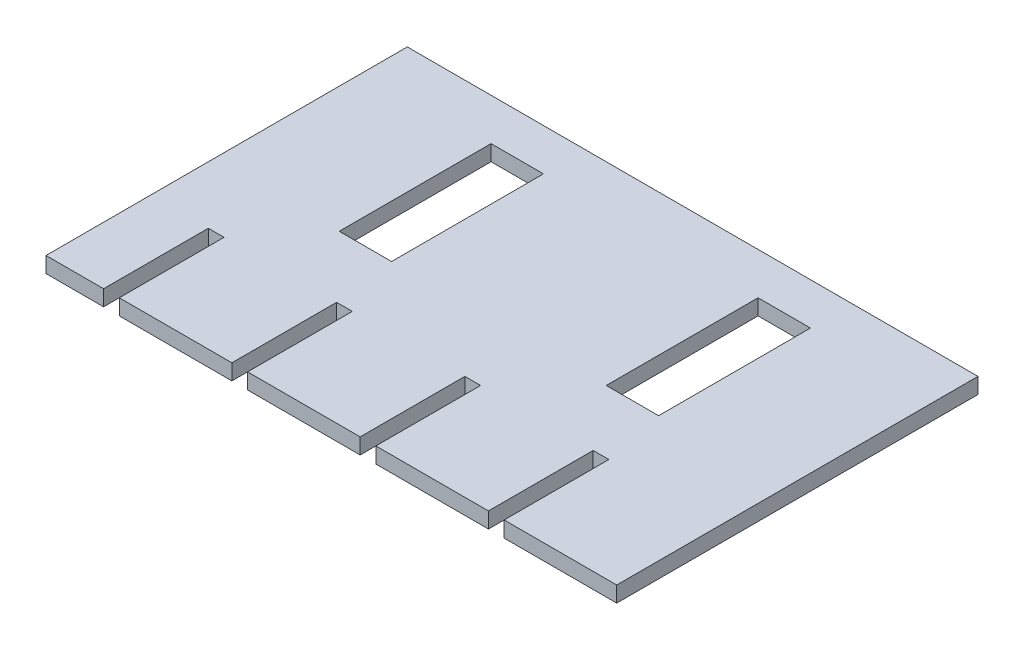
ISO-10303-21;
HEADER;
FILE_DESCRIPTION(('STEP AP214'),'2;1');
FILE_NAME('part.step','',(''),(''),'','','');
FILE_SCHEMA(('AUTOMOTIVE_DESIGN { 1 0 10303 214 1 1 1 1 }'));
ENDSEC;
DATA;
#1=APPLICATION_CONTEXT('core data for automotive mechanical design processes');
#2=APPLICATION_PROTOCOL_DEFINITION('international standard','automotive_design',2000,#1);
#3=PRODUCT_CONTEXT('',#1,'mechanical');
#4=PRODUCT('Part','Part','',(#3));
#5=PRODUCT_RELATED_PRODUCT_CATEGORY('part','',(#4));
#6=PRODUCT_DEFINITION_FORMATION('','',#4);
#7=PRODUCT_DEFINITION_CONTEXT('part definition',#1,'design');
#8=PRODUCT_DEFINITION('design','',#6,#7);
#9=PRODUCT_DEFINITION_SHAPE('','',#8);
#10=(LENGTH_UNIT() NAMED_UNIT(*) SI_UNIT(.MILLI.,.METRE.));
#11=(NAMED_UNIT(*) PLANE_ANGLE_UNIT() SI_UNIT($,.RADIAN.));
#12=(NAMED_UNIT(*) SI_UNIT($,.STERADIAN.) SOLID_ANGLE_UNIT());
#13=UNCERTAINTY_MEASURE_WITH_UNIT(LENGTH_MEASURE(1.E-05),#10,'distance_accuracy_value','');
#14=(GEOMETRIC_REPRESENTATION_CONTEXT(3) GLOBAL_UNCERTAINTY_ASSIGNED_CONTEXT((#13)) GLOBAL_UNIT_ASSIGNED_CONTEXT((#10,
#11,#12)) REPRESENTATION_CONTEXT('',''));
#15=CARTESIAN_POINT('',(0.,0.,0.));
#16=DIRECTION('',(0.,0.,1.));
#17=DIRECTION('',(1.,0.,0.));
#18=AXIS2_PLACEMENT_3D('',#15,#16,#17);
#19=CARTESIAN_POINT('',(-27.25,1.5,17.25));
#20=DIRECTION('',(0.,0.,-1.));
#21=DIRECTION('',(-1.,0.,0.));
#22=AXIS2_PLACEMENT_3D('',#19,#20,#21);
#23=PLANE('',#22);
#24=DIRECTION('',(1.,0.,0.));
#25=VECTOR('',#24,1.);
#26=CARTESIAN_POINT('',(-27.25,0.,17.25));
#27=LINE('',#26,#25);
#28=CARTESIAN_POINT('',(4.25,0.,17.25));
#29=VERTEX_POINT('',#28);
#30=CARTESIAN_POINT('',(15.,0.,17.25));
#31=VERTEX_POINT('',#30);
#32=EDGE_CURVE('E461',#29,#31,#27,.T.);
#33=ORIENTED_EDGE('',*,*,#32,.T.);
#34=DIRECTION('',(0.,1.,0.));
#35=VECTOR('',#34,1.);
#36=CARTESIAN_POINT('',(15.,-0.5,17.25));
#37=LINE('',#36,#35);
#38=CARTESIAN_POINT('',(15.,1.5,17.25));
#39=VERTEX_POINT('',#38);
#40=EDGE_CURVE('E425',#31,#39,#37,.T.);
#41=ORIENTED_EDGE('',*,*,#40,.T.);
#42=DIRECTION('',(1.,0.,0.));
#43=VECTOR('',#42,1.);
#44=CARTESIAN_POINT('',(-27.25,1.5,17.25));
#45=LINE('',#44,#43);
#46=CARTESIAN_POINT('',(4.25,1.5,17.25));
#47=VERTEX_POINT('',#46);
#48=EDGE_CURVE('E242',#47,#39,#45,.T.);
#49=ORIENTED_EDGE('',*,*,#48,.F.);
#50=DIRECTION('',(0.,1.,0.));
#51=VECTOR('',#50,1.);
#52=CARTESIAN_POINT('',(4.25,-0.5,17.25));
#53=LINE('',#52,#51);
#54=EDGE_CURVE('E300',#29,#47,#53,.T.);
#55=ORIENTED_EDGE('',*,*,#54,.F.);
#56=EDGE_LOOP('',(#33,#41,#49,#55));
#57=FACE_BOUND('',#56,.T.);
#58=ADVANCED_FACE('F33',(#57),#23,.F.);
#59=CARTESIAN_POINT('',(-20.25,0.,17.25));
#60=VERTEX_POINT('',#59);
#61=CARTESIAN_POINT('',(-9.5,0.,17.25));
#62=VERTEX_POINT('',#61);
#63=EDGE_CURVE('E274',#60,#62,#27,.T.);
#64=ORIENTED_EDGE('',*,*,#63,.T.);
#65=DIRECTION('',(0.,1.,0.));
#66=VECTOR('',#65,1.);
#67=CARTESIAN_POINT('',(-9.5,-0.5,17.25));
#68=LINE('',#67,#66);
#69=CARTESIAN_POINT('',(-9.5,1.5,17.25));
#70=VERTEX_POINT('',#69);
#71=EDGE_CURVE('E273',#62,#70,#68,.T.);
#72=ORIENTED_EDGE('',*,*,#71,.T.);
#73=CARTESIAN_POINT('',(-20.25,1.5,17.25));
#74=VERTEX_POINT('',#73);
#75=EDGE_CURVE('E248',#74,#70,#45,.T.);
#76=ORIENTED_EDGE('',*,*,#75,.F.);
#77=DIRECTION('',(0.,1.,0.));
#78=VECTOR('',#77,1.);
#79=CARTESIAN_POINT('',(-20.25,-0.5,17.25));
#80=LINE('',#79,#78);
#81=EDGE_CURVE('E271',#60,#74,#80,.T.);
#82=ORIENTED_EDGE('',*,*,#81,.F.);
#83=EDGE_LOOP('',(#64,#72,#76,#82));
#84=FACE_BOUND('',#83,.T.);
#85=ADVANCED_FACE('F270',(#84),#23,.F.);
#86=CARTESIAN_POINT('',(-8.,1.5,17.25));
#87=VERTEX_POINT('',#86);
#88=CARTESIAN_POINT('',(2.75,1.5,17.25));
#89=VERTEX_POINT('',#88);
#90=EDGE_CURVE('E245',#87,#89,#45,.T.);
#91=ORIENTED_EDGE('',*,*,#90,.F.);
#92=DIRECTION('',(0.,1.,0.));
#93=VECTOR('',#92,1.);
#94=CARTESIAN_POINT('',(-8.,-0.5,17.25));
#95=LINE('',#94,#93);
#96=CARTESIAN_POINT('',(-8.,0.,17.25));
#97=VERTEX_POINT('',#96);
#98=EDGE_CURVE('E288',#97,#87,#95,.T.);
#99=ORIENTED_EDGE('',*,*,#98,.F.);
#100=CARTESIAN_POINT('',(2.75,0.,17.25));
#101=VERTEX_POINT('',#100);
#102=EDGE_CURVE('E440',#97,#101,#27,.T.);
#103=ORIENTED_EDGE('',*,*,#102,.T.);
#104=DIRECTION('',(0.,1.,0.));
#105=VECTOR('',#104,1.);
#106=CARTESIAN_POINT('',(2.75,-0.5,17.25));
#107=LINE('',#106,#105);
#108=EDGE_CURVE('E295',#101,#89,#107,.T.);
#109=ORIENTED_EDGE('',*,*,#108,.T.);
#110=EDGE_LOOP('',(#91,#99,#103,#109));
#111=FACE_BOUND('',#110,.T.);
#112=ADVANCED_FACE('F446',(#111),#23,.F.);
#113=CARTESIAN_POINT('',(-27.25,0.,17.25));
#114=VERTEX_POINT('',#113);
#115=CARTESIAN_POINT('',(-21.75,0.,17.25));
#116=VERTEX_POINT('',#115);
#117=EDGE_CURVE('E361',#114,#116,#27,.T.);
#118=ORIENTED_EDGE('',*,*,#117,.T.);
#119=DIRECTION('',(0.,1.,0.));
#120=VECTOR('',#119,1.);
#121=CARTESIAN_POINT('',(-21.75,-0.5,17.25));
#122=LINE('',#121,#120);
#123=CARTESIAN_POINT('',(-21.75,1.5,17.25));
#124=VERTEX_POINT('',#123);
#125=EDGE_CURVE('E310',#116,#124,#122,.T.);
#126=ORIENTED_EDGE('',*,*,#125,.T.);
#127=CARTESIAN_POINT('',(-27.25,1.5,17.25));
#128=VERTEX_POINT('',#127);
#129=EDGE_CURVE('E246',#128,#124,#45,.T.);
#130=ORIENTED_EDGE('',*,*,#129,.F.);
#131=DIRECTION('',(0.,-1.,0.));
#132=VECTOR('',#131,1.);
#133=CARTESIAN_POINT('',(-27.25,1.5,17.25));
#134=LINE('',#133,#132);
#135=EDGE_CURVE('E255',#128,#114,#134,.T.);
#136=ORIENTED_EDGE('',*,*,#135,.T.);
#137=EDGE_LOOP('',(#118,#126,#130,#136));
#138=FACE_BOUND('',#137,.T.);
#139=ADVANCED_FACE('F383',(#138),#23,.F.);
#140=CARTESIAN_POINT('',(27.25,1.5,-17.25));
#141=DIRECTION('',(-1.,0.,0.));
#142=DIRECTION('',(0.,0.,1.));
#143=AXIS2_PLACEMENT_3D('',#140,#141,#142);
#144=PLANE('',#143);
#145=DIRECTION('',(0.,0.,-1.));
#146=VECTOR('',#145,1.);
#147=CARTESIAN_POINT('',(27.25,0.,-17.25));
#148=LINE('',#147,#146);
#149=CARTESIAN_POINT('',(27.25,0.,17.25));
#150=VERTEX_POINT('',#149);
#151=CARTESIAN_POINT('',(27.25,0.,-17.25));
#152=VERTEX_POINT('',#151);
#153=EDGE_CURVE('E352',#150,#152,#148,.T.);
#154=ORIENTED_EDGE('',*,*,#153,.T.);
#155=DIRECTION('',(0.,-1.,0.));
#156=VECTOR('',#155,1.);
#157=CARTESIAN_POINT('',(27.25,1.5,-17.25));
#158=LINE('',#157,#156);
#159=CARTESIAN_POINT('',(27.25,1.5,-17.25));
#160=VERTEX_POINT('',#159);
#161=EDGE_CURVE('E374',#160,#152,#158,.T.);
#162=ORIENTED_EDGE('',*,*,#161,.F.);
#163=DIRECTION('',(0.,0.,-1.));
#164=VECTOR('',#163,1.);
#165=CARTESIAN_POINT('',(27.25,1.5,-17.25));
#166=LINE('',#165,#164);
#167=CARTESIAN_POINT('',(27.25,1.5,17.25));
#168=VERTEX_POINT('',#167);
#169=EDGE_CURVE('E359',#168,#160,#166,.T.);
#170=ORIENTED_EDGE('',*,*,#169,.F.);
#171=DIRECTION('',(0.,-1.,0.));
#172=VECTOR('',#171,1.);
#173=CARTESIAN_POINT('',(27.25,1.5,17.25));
#174=LINE('',#173,#172);
#175=EDGE_CURVE('E240',#168,#150,#174,.T.);
#176=ORIENTED_EDGE('',*,*,#175,.T.);
#177=EDGE_LOOP('',(#154,#162,#170,#176));
#178=FACE_BOUND('',#177,.T.);
#179=ADVANCED_FACE('F35',(#178),#144,.F.);
#180=CARTESIAN_POINT('',(-27.25,1.5,-17.25));
#181=DIRECTION('',(0.,0.,1.));
#182=DIRECTION('',(1.,0.,0.));
#183=AXIS2_PLACEMENT_3D('',#180,#181,#182);
#184=PLANE('',#183);
#185=DIRECTION('',(-1.,0.,0.));
#186=VECTOR('',#185,1.);
#187=CARTESIAN_POINT('',(-27.25,0.,-17.25));
#188=LINE('',#187,#186);
#189=CARTESIAN_POINT('',(-27.25,0.,-17.25));
#190=VERTEX_POINT('',#189);
#191=EDGE_CURVE('E371',#152,#190,#188,.T.);
#192=ORIENTED_EDGE('',*,*,#191,.T.);
#193=DIRECTION('',(0.,-1.,0.));
#194=VECTOR('',#193,1.);
#195=CARTESIAN_POINT('',(-27.25,1.5,-17.25));
#196=LINE('',#195,#194);
#197=CARTESIAN_POINT('',(-27.25,1.5,-17.25));
#198=VERTEX_POINT('',#197);
#199=EDGE_CURVE('E369',#198,#190,#196,.T.);
#200=ORIENTED_EDGE('',*,*,#199,.F.);
#201=DIRECTION('',(-1.,0.,0.));
#202=VECTOR('',#201,1.);
#203=CARTESIAN_POINT('',(-27.25,1.5,-17.25));
#204=LINE('',#203,#202);
#205=EDGE_CURVE('E249',#160,#198,#204,.T.);
#206=ORIENTED_EDGE('',*,*,#205,.F.);
#207=ORIENTED_EDGE('',*,*,#161,.T.);
#208=EDGE_LOOP('',(#192,#200,#206,#207));
#209=FACE_BOUND('',#208,.T.);
#210=ADVANCED_FACE('F370',(#209),#184,.F.);
#211=CARTESIAN_POINT('',(-27.25,1.5,-17.25));
#212=DIRECTION('',(1.,0.,0.));
#213=DIRECTION('',(0.,0.,-1.));
#214=AXIS2_PLACEMENT_3D('',#211,#212,#213);
#215=PLANE('',#214);
#216=DIRECTION('',(0.,0.,1.));
#217=VECTOR('',#216,1.);
#218=CARTESIAN_POINT('',(-27.25,0.,-17.25));
#219=LINE('',#218,#217);
#220=EDGE_CURVE('E378',#190,#114,#219,.T.);
#221=ORIENTED_EDGE('',*,*,#220,.T.);
#222=ORIENTED_EDGE('',*,*,#135,.F.);
#223=DIRECTION('',(0.,0.,1.));
#224=VECTOR('',#223,1.);
#225=CARTESIAN_POINT('',(-27.25,1.5,-17.25));
#226=LINE('',#225,#224);
#227=EDGE_CURVE('E243',#198,#128,#226,.T.);
#228=ORIENTED_EDGE('',*,*,#227,.F.);
#229=ORIENTED_EDGE('',*,*,#199,.T.);
#230=EDGE_LOOP('',(#221,#222,#228,#229));
#231=FACE_BOUND('',#230,.T.);
#232=ADVANCED_FACE('F376',(#231),#215,.F.);
#233=CARTESIAN_POINT('',(16.5,1.5,17.25));
#234=VERTEX_POINT('',#233);
#235=EDGE_CURVE('E233',#234,#168,#45,.T.);
#236=ORIENTED_EDGE('',*,*,#235,.F.);
#237=DIRECTION('',(0.,1.,0.));
#238=VECTOR('',#237,1.);
#239=CARTESIAN_POINT('',(16.5,-0.5,17.25));
#240=LINE('',#239,#238);
#241=CARTESIAN_POINT('',(16.5,0.,17.25));
#242=VERTEX_POINT('',#241);
#243=EDGE_CURVE('E216',#242,#234,#240,.T.);
#244=ORIENTED_EDGE('',*,*,#243,.F.);
#245=EDGE_CURVE('E748',#242,#150,#27,.T.);
#246=ORIENTED_EDGE('',*,*,#245,.T.);
#247=ORIENTED_EDGE('',*,*,#175,.F.);
#248=EDGE_LOOP('',(#236,#244,#246,#247));
#249=FACE_BOUND('',#248,.T.);
#250=ADVANCED_FACE('F238',(#249),#23,.F.);
#251=CARTESIAN_POINT('',(0.,1.5,0.));
#252=DIRECTION('',(0.,1.,0.));
#253=DIRECTION('',(0.,0.,1.));
#254=AXIS2_PLACEMENT_3D('',#251,#252,#253);
#255=PLANE('',#254);
#256=DIRECTION('',(0.,0.,1.));
#257=VECTOR('',#256,1.);
#258=CARTESIAN_POINT('',(15.,1.5,17.25));
#259=LINE('',#258,#257);
#260=CARTESIAN_POINT('',(15.,1.5,7.25));
#261=VERTEX_POINT('',#260);
#262=EDGE_CURVE('E226',#261,#39,#259,.T.);
#263=ORIENTED_EDGE('',*,*,#262,.F.);
#264=DIRECTION('',(-1.,0.,0.));
#265=VECTOR('',#264,1.);
#266=CARTESIAN_POINT('',(15.,1.5,7.25));
#267=LINE('',#266,#265);
#268=CARTESIAN_POINT('',(16.5,1.5,7.25));
#269=VERTEX_POINT('',#268);
#270=EDGE_CURVE('E236',#269,#261,#267,.T.);
#271=ORIENTED_EDGE('',*,*,#270,.F.);
#272=DIRECTION('',(0.,0.,-1.));
#273=VECTOR('',#272,1.);
#274=CARTESIAN_POINT('',(16.5,1.5,7.25));
#275=LINE('',#274,#273);
#276=EDGE_CURVE('E219',#234,#269,#275,.T.);
#277=ORIENTED_EDGE('',*,*,#276,.F.);
#278=ORIENTED_EDGE('',*,*,#235,.T.);
#279=ORIENTED_EDGE('',*,*,#169,.T.);
#280=ORIENTED_EDGE('',*,*,#205,.T.);
#281=ORIENTED_EDGE('',*,*,#227,.T.);
#282=ORIENTED_EDGE('',*,*,#129,.T.);
#283=DIRECTION('',(0.,0.,1.));
#284=VECTOR('',#283,1.);
#285=CARTESIAN_POINT('',(-21.75,1.5,17.25));
#286=LINE('',#285,#284);
#287=CARTESIAN_POINT('',(-21.75,1.5,7.25));
#288=VERTEX_POINT('',#287);
#289=EDGE_CURVE('E308',#288,#124,#286,.T.);
#290=ORIENTED_EDGE('',*,*,#289,.F.);
#291=DIRECTION('',(-1.,0.,0.));
#292=VECTOR('',#291,1.);
#293=CARTESIAN_POINT('',(-21.75,1.5,7.25));
#294=LINE('',#293,#292);
#295=CARTESIAN_POINT('',(-20.25,1.5,7.25));
#296=VERTEX_POINT('',#295);
#297=EDGE_CURVE('E305',#296,#288,#294,.T.);
#298=ORIENTED_EDGE('',*,*,#297,.F.);
#299=DIRECTION('',(0.,0.,-1.));
#300=VECTOR('',#299,1.);
#301=CARTESIAN_POINT('',(-20.25,1.5,7.25));
#302=LINE('',#301,#300);
#303=EDGE_CURVE('E265',#74,#296,#302,.T.);
#304=ORIENTED_EDGE('',*,*,#303,.F.);
#305=ORIENTED_EDGE('',*,*,#75,.T.);
#306=DIRECTION('',(0.,0.,1.));
#307=VECTOR('',#306,1.);
#308=CARTESIAN_POINT('',(-9.5,1.5,17.25));
#309=LINE('',#308,#307);
#310=CARTESIAN_POINT('',(-9.5,1.5,7.25));
#311=VERTEX_POINT('',#310);
#312=EDGE_CURVE('E262',#311,#70,#309,.T.);
#313=ORIENTED_EDGE('',*,*,#312,.F.);
#314=DIRECTION('',(-1.,0.,0.));
#315=VECTOR('',#314,1.);
#316=CARTESIAN_POINT('',(-9.5,1.5,7.25));
#317=LINE('',#316,#315);
#318=CARTESIAN_POINT('',(-8.,1.5,7.25));
#319=VERTEX_POINT('',#318);
#320=EDGE_CURVE('E433',#319,#311,#317,.T.);
#321=ORIENTED_EDGE('',*,*,#320,.F.);
#322=DIRECTION('',(0.,0.,-1.));
#323=VECTOR('',#322,1.);
#324=CARTESIAN_POINT('',(-8.,1.5,7.25));
#325=LINE('',#324,#323);
#326=EDGE_CURVE('E428',#87,#319,#325,.T.);
#327=ORIENTED_EDGE('',*,*,#326,.F.);
#328=ORIENTED_EDGE('',*,*,#90,.T.);
#329=DIRECTION('',(0.,0.,1.));
#330=VECTOR('',#329,1.);
#331=CARTESIAN_POINT('',(2.75,1.5,17.25));
#332=LINE('',#331,#330);
#333=CARTESIAN_POINT('',(2.75,1.5,7.25));
#334=VERTEX_POINT('',#333);
#335=EDGE_CURVE('E277',#334,#89,#332,.T.);
#336=ORIENTED_EDGE('',*,*,#335,.F.);
#337=DIRECTION('',(-1.,0.,0.));
#338=VECTOR('',#337,1.);
#339=CARTESIAN_POINT('',(2.75,1.5,7.25));
#340=LINE('',#339,#338);
#341=CARTESIAN_POINT('',(4.25,1.5,7.25));
#342=VERTEX_POINT('',#341);
#343=EDGE_CURVE('E292',#342,#334,#340,.T.);
#344=ORIENTED_EDGE('',*,*,#343,.F.);
#345=DIRECTION('',(0.,0.,-1.));
#346=VECTOR('',#345,1.);
#347=CARTESIAN_POINT('',(4.25,1.5,7.25));
#348=LINE('',#347,#346);
#349=EDGE_CURVE('E281',#47,#342,#348,.T.);
#350=ORIENTED_EDGE('',*,*,#349,.F.);
#351=ORIENTED_EDGE('',*,*,#48,.T.);
#352=EDGE_LOOP('',(#263,#271,#277,#278,#279,#280,#281,#282,#290,#298,#304,#305,#313,#321,#327,
#328,#336,#344,#350,#351));
#353=FACE_BOUND('',#352,.T.);
#354=DIRECTION('',(0.,0.,-1.));
#355=VECTOR('',#354,1.);
#356=CARTESIAN_POINT('',(15.25,1.5,-13.25));
#357=LINE('',#356,#355);
#358=CARTESIAN_POINT('',(15.25,1.5,1.25));
#359=VERTEX_POINT('',#358);
#360=CARTESIAN_POINT('',(15.25,1.5,-13.25));
#361=VERTEX_POINT('',#360);
#362=EDGE_CURVE('E313',#359,#361,#357,.T.);
#363=ORIENTED_EDGE('',*,*,#362,.F.);
#364=DIRECTION('',(1.,0.,0.));
#365=VECTOR('',#364,1.);
#366=CARTESIAN_POINT('',(10.25,1.5,1.25));
#367=LINE('',#366,#365);
#368=CARTESIAN_POINT('',(10.25,1.5,1.25));
#369=VERTEX_POINT('',#368);
#370=EDGE_CURVE('E326',#369,#359,#367,.T.);
#371=ORIENTED_EDGE('',*,*,#370,.F.);
#372=DIRECTION('',(0.,0.,1.));
#373=VECTOR('',#372,1.);
#374=CARTESIAN_POINT('',(10.25,1.5,-13.25));
#375=LINE('',#374,#373);
#376=CARTESIAN_POINT('',(10.25,1.5,-13.25));
#377=VERTEX_POINT('',#376);
#378=EDGE_CURVE('E323',#377,#369,#375,.T.);
#379=ORIENTED_EDGE('',*,*,#378,.F.);
#380=DIRECTION('',(-1.,0.,0.));
#381=VECTOR('',#380,1.);
#382=CARTESIAN_POINT('',(10.25,1.5,-13.25));
#383=LINE('',#382,#381);
#384=EDGE_CURVE('E320',#361,#377,#383,.T.);
#385=ORIENTED_EDGE('',*,*,#384,.F.);
#386=EDGE_LOOP('',(#363,#371,#379,#385));
#387=FACE_BOUND('',#386,.T.);
#388=DIRECTION('',(0.,0.,-1.));
#389=VECTOR('',#388,1.);
#390=CARTESIAN_POINT('',(-10.25,1.5,-13.25));
#391=LINE('',#390,#389);
#392=CARTESIAN_POINT('',(-10.25,1.5,1.25));
#393=VERTEX_POINT('',#392);
#394=CARTESIAN_POINT('',(-10.25,1.5,-13.25));
#395=VERTEX_POINT('',#394);
#396=EDGE_CURVE('E332',#393,#395,#391,.T.);
#397=ORIENTED_EDGE('',*,*,#396,.F.);
#398=DIRECTION('',(1.,0.,0.));
#399=VECTOR('',#398,1.);
#400=CARTESIAN_POINT('',(-15.25,1.5,1.25));
#401=LINE('',#400,#399);
#402=CARTESIAN_POINT('',(-15.25,1.5,1.25));
#403=VERTEX_POINT('',#402);
#404=EDGE_CURVE('E346',#403,#393,#401,.T.);
#405=ORIENTED_EDGE('',*,*,#404,.F.);
#406=DIRECTION('',(0.,0.,1.));
#407=VECTOR('',#406,1.);
#408=CARTESIAN_POINT('',(-15.25,1.5,-13.25));
#409=LINE('',#408,#407);
#410=CARTESIAN_POINT('',(-15.25,1.5,-13.25));
#411=VERTEX_POINT('',#410);
#412=EDGE_CURVE('E343',#411,#403,#409,.T.);
#413=ORIENTED_EDGE('',*,*,#412,.F.);
#414=DIRECTION('',(-1.,0.,0.));
#415=VECTOR('',#414,1.);
#416=CARTESIAN_POINT('',(-15.25,1.5,-13.25));
#417=LINE('',#416,#415);
#418=EDGE_CURVE('E340',#395,#411,#417,.T.);
#419=ORIENTED_EDGE('',*,*,#418,.F.);
#420=EDGE_LOOP('',(#397,#405,#413,#419));
#421=FACE_BOUND('',#420,.T.);
#422=ADVANCED_FACE('F230',(#353,#387,#421),#255,.T.);
#423=CARTESIAN_POINT('',(0.,0.,0.));
#424=DIRECTION('',(0.,1.,0.));
#425=DIRECTION('',(0.,0.,1.));
#426=AXIS2_PLACEMENT_3D('',#423,#424,#425);
#427=PLANE('',#426);
#428=DIRECTION('',(1.,0.,0.));
#429=VECTOR('',#428,1.);
#430=CARTESIAN_POINT('',(0.,0.,1.25));
#431=LINE('',#430,#429);
#432=CARTESIAN_POINT('',(10.25,0.,1.25));
#433=VERTEX_POINT('',#432);
#434=CARTESIAN_POINT('',(15.25,0.,1.25));
#435=VERTEX_POINT('',#434);
#436=EDGE_CURVE('E723',#433,#435,#431,.T.);
#437=ORIENTED_EDGE('',*,*,#436,.T.);
#438=DIRECTION('',(0.,0.,-1.));
#439=VECTOR('',#438,1.);
#440=CARTESIAN_POINT('',(15.25,0.,0.));
#441=LINE('',#440,#439);
#442=CARTESIAN_POINT('',(15.25,0.,-13.25));
#443=VERTEX_POINT('',#442);
#444=EDGE_CURVE('E746',#435,#443,#441,.T.);
#445=ORIENTED_EDGE('',*,*,#444,.T.);
#446=DIRECTION('',(-1.,0.,0.));
#447=VECTOR('',#446,1.);
#448=CARTESIAN_POINT('',(0.,0.,-13.25));
#449=LINE('',#448,#447);
#450=CARTESIAN_POINT('',(10.25,0.,-13.25));
#451=VERTEX_POINT('',#450);
#452=EDGE_CURVE('E735',#443,#451,#449,.T.);
#453=ORIENTED_EDGE('',*,*,#452,.T.);
#454=DIRECTION('',(0.,0.,1.));
#455=VECTOR('',#454,1.);
#456=CARTESIAN_POINT('',(10.25,0.,0.));
#457=LINE('',#456,#455);
#458=EDGE_CURVE('E743',#451,#433,#457,.T.);
#459=ORIENTED_EDGE('',*,*,#458,.T.);
#460=EDGE_LOOP('',(#437,#445,#453,#459));
#461=FACE_BOUND('',#460,.T.);
#462=DIRECTION('',(1.,0.,0.));
#463=VECTOR('',#462,1.);
#464=CARTESIAN_POINT('',(0.,0.,1.25));
#465=LINE('',#464,#463);
#466=CARTESIAN_POINT('',(-15.25,0.,1.25));
#467=VERTEX_POINT('',#466);
#468=CARTESIAN_POINT('',(-10.25,0.,1.25));
#469=VERTEX_POINT('',#468);
#470=EDGE_CURVE('E727',#467,#469,#465,.T.);
#471=ORIENTED_EDGE('',*,*,#470,.T.);
#472=DIRECTION('',(0.,0.,-1.));
#473=VECTOR('',#472,1.);
#474=CARTESIAN_POINT('',(-10.25,0.,0.));
#475=LINE('',#474,#473);
#476=CARTESIAN_POINT('',(-10.25,0.,-13.25));
#477=VERTEX_POINT('',#476);
#478=EDGE_CURVE('E729',#469,#477,#475,.T.);
#479=ORIENTED_EDGE('',*,*,#478,.T.);
#480=DIRECTION('',(-1.,0.,0.));
#481=VECTOR('',#480,1.);
#482=CARTESIAN_POINT('',(0.,0.,-13.25));
#483=LINE('',#482,#481);
#484=CARTESIAN_POINT('',(-15.25,0.,-13.25));
#485=VERTEX_POINT('',#484);
#486=EDGE_CURVE('E737',#477,#485,#483,.T.);
#487=ORIENTED_EDGE('',*,*,#486,.T.);
#488=DIRECTION('',(0.,0.,1.));
#489=VECTOR('',#488,1.);
#490=CARTESIAN_POINT('',(-15.25,0.,0.));
#491=LINE('',#490,#489);
#492=EDGE_CURVE('E731',#485,#467,#491,.T.);
#493=ORIENTED_EDGE('',*,*,#492,.T.);
#494=EDGE_LOOP('',(#471,#479,#487,#493));
#495=FACE_BOUND('',#494,.T.);
#496=DIRECTION('',(-1.,0.,0.));
#497=VECTOR('',#496,1.);
#498=CARTESIAN_POINT('',(0.,0.,7.25));
#499=LINE('',#498,#497);
#500=CARTESIAN_POINT('',(16.5,0.,7.25));
#501=VERTEX_POINT('',#500);
#502=CARTESIAN_POINT('',(15.,0.,7.25));
#503=VERTEX_POINT('',#502);
#504=EDGE_CURVE('E41',#501,#503,#499,.T.);
#505=ORIENTED_EDGE('',*,*,#504,.T.);
#506=DIRECTION('',(0.,0.,1.));
#507=VECTOR('',#506,1.);
#508=CARTESIAN_POINT('',(15.,0.,0.));
#509=LINE('',#508,#507);
#510=EDGE_CURVE('E11',#503,#31,#509,.T.);
#511=ORIENTED_EDGE('',*,*,#510,.T.);
#512=ORIENTED_EDGE('',*,*,#32,.F.);
#513=DIRECTION('',(0.,0.,-1.));
#514=VECTOR('',#513,1.);
#515=CARTESIAN_POINT('',(4.25,0.,0.));
#516=LINE('',#515,#514);
#517=CARTESIAN_POINT('',(4.25,0.,7.25));
#518=VERTEX_POINT('',#517);
#519=EDGE_CURVE('E396',#29,#518,#516,.T.);
#520=ORIENTED_EDGE('',*,*,#519,.T.);
#521=DIRECTION('',(-1.,0.,0.));
#522=VECTOR('',#521,1.);
#523=CARTESIAN_POINT('',(0.,0.,7.25));
#524=LINE('',#523,#522);
#525=CARTESIAN_POINT('',(2.75,0.,7.25));
#526=VERTEX_POINT('',#525);
#527=EDGE_CURVE('E399',#518,#526,#524,.T.);
#528=ORIENTED_EDGE('',*,*,#527,.T.);
#529=DIRECTION('',(0.,0.,1.));
#530=VECTOR('',#529,1.);
#531=CARTESIAN_POINT('',(2.75,0.,0.));
#532=LINE('',#531,#530);
#533=EDGE_CURVE('E407',#526,#101,#532,.T.);
#534=ORIENTED_EDGE('',*,*,#533,.T.);
#535=ORIENTED_EDGE('',*,*,#102,.F.);
#536=DIRECTION('',(0.,0.,-1.));
#537=VECTOR('',#536,1.);
#538=CARTESIAN_POINT('',(-8.,0.,0.));
#539=LINE('',#538,#537);
#540=CARTESIAN_POINT('',(-8.,0.,7.25));
#541=VERTEX_POINT('',#540);
#542=EDGE_CURVE('E410',#97,#541,#539,.T.);
#543=ORIENTED_EDGE('',*,*,#542,.T.);
#544=DIRECTION('',(-1.,0.,0.));
#545=VECTOR('',#544,1.);
#546=CARTESIAN_POINT('',(0.,0.,7.25));
#547=LINE('',#546,#545);
#548=CARTESIAN_POINT('',(-9.5,0.,7.25));
#549=VERTEX_POINT('',#548);
#550=EDGE_CURVE('E413',#541,#549,#547,.T.);
#551=ORIENTED_EDGE('',*,*,#550,.T.);
#552=DIRECTION('',(0.,0.,1.));
#553=VECTOR('',#552,1.);
#554=CARTESIAN_POINT('',(-9.5,0.,0.));
#555=LINE('',#554,#553);
#556=EDGE_CURVE('E416',#549,#62,#555,.T.);
#557=ORIENTED_EDGE('',*,*,#556,.T.);
#558=ORIENTED_EDGE('',*,*,#63,.F.);
#559=DIRECTION('',(0.,0.,-1.));
#560=VECTOR('',#559,1.);
#561=CARTESIAN_POINT('',(-20.25,0.,0.));
#562=LINE('',#561,#560);
#563=CARTESIAN_POINT('',(-20.25,0.,7.25));
#564=VERTEX_POINT('',#563);
#565=EDGE_CURVE('E401',#60,#564,#562,.T.);
#566=ORIENTED_EDGE('',*,*,#565,.T.);
#567=DIRECTION('',(-1.,0.,0.));
#568=VECTOR('',#567,1.);
#569=CARTESIAN_POINT('',(0.,0.,7.25));
#570=LINE('',#569,#568);
#571=CARTESIAN_POINT('',(-21.75,0.,7.25));
#572=VERTEX_POINT('',#571);
#573=EDGE_CURVE('E395',#564,#572,#570,.T.);
#574=ORIENTED_EDGE('',*,*,#573,.T.);
#575=DIRECTION('',(0.,0.,1.));
#576=VECTOR('',#575,1.);
#577=CARTESIAN_POINT('',(-21.75,0.,0.));
#578=LINE('',#577,#576);
#579=EDGE_CURVE('E387',#572,#116,#578,.T.);
#580=ORIENTED_EDGE('',*,*,#579,.T.);
#581=ORIENTED_EDGE('',*,*,#117,.F.);
#582=ORIENTED_EDGE('',*,*,#220,.F.);
#583=ORIENTED_EDGE('',*,*,#191,.F.);
#584=ORIENTED_EDGE('',*,*,#153,.F.);
#585=ORIENTED_EDGE('',*,*,#245,.F.);
#586=DIRECTION('',(0.,0.,-1.));
#587=VECTOR('',#586,1.);
#588=CARTESIAN_POINT('',(16.5,0.,0.));
#589=LINE('',#588,#587);
#590=EDGE_CURVE('E222',#242,#501,#589,.T.);
#591=ORIENTED_EDGE('',*,*,#590,.T.);
#592=EDGE_LOOP('',(#505,#511,#512,#520,#528,#534,#535,#543,#551,#557,#558,#566,#574,#580,#581,
#582,#583,#584,#585,#591));
#593=FACE_BOUND('',#592,.T.);
#594=ADVANCED_FACE('F392',(#461,#495,#593),#427,.F.);
#595=CARTESIAN_POINT('',(-10.25,-0.5,-13.25));
#596=DIRECTION('',(1.,0.,0.));
#597=DIRECTION('',(0.,0.,-1.));
#598=AXIS2_PLACEMENT_3D('',#595,#596,#597);
#599=PLANE('',#598);
#600=DIRECTION('',(0.,1.,0.));
#601=VECTOR('',#600,1.);
#602=CARTESIAN_POINT('',(-10.25,-0.5,1.25));
#603=LINE('',#602,#601);
#604=EDGE_CURVE('E350',#469,#393,#603,.T.);
#605=ORIENTED_EDGE('',*,*,#604,.T.);
#606=ORIENTED_EDGE('',*,*,#396,.T.);
#607=DIRECTION('',(0.,1.,0.));
#608=VECTOR('',#607,1.);
#609=CARTESIAN_POINT('',(-10.25,-0.5,-13.25));
#610=LINE('',#609,#608);
#611=EDGE_CURVE('E349',#477,#395,#610,.T.);
#612=ORIENTED_EDGE('',*,*,#611,.F.);
#613=ORIENTED_EDGE('',*,*,#478,.F.);
#614=EDGE_LOOP('',(#605,#606,#612,#613));
#615=FACE_BOUND('',#614,.T.);
#616=ADVANCED_FACE('F627',(#615),#599,.F.);
#617=CARTESIAN_POINT('',(-15.25,-0.5,1.25));
#618=DIRECTION('',(0.,0.,1.));
#619=DIRECTION('',(1.,0.,0.));
#620=AXIS2_PLACEMENT_3D('',#617,#618,#619);
#621=PLANE('',#620);
#622=DIRECTION('',(0.,1.,0.));
#623=VECTOR('',#622,1.);
#624=CARTESIAN_POINT('',(-15.25,-0.5,1.25));
#625=LINE('',#624,#623);
#626=EDGE_CURVE('E353',#467,#403,#625,.T.);
#627=ORIENTED_EDGE('',*,*,#626,.T.);
#628=ORIENTED_EDGE('',*,*,#404,.T.);
#629=ORIENTED_EDGE('',*,*,#604,.F.);
#630=ORIENTED_EDGE('',*,*,#470,.F.);
#631=EDGE_LOOP('',(#627,#628,#629,#630));
#632=FACE_BOUND('',#631,.T.);
#633=ADVANCED_FACE('F617',(#632),#621,.F.);
#634=CARTESIAN_POINT('',(-15.25,-0.5,-13.25));
#635=DIRECTION('',(-1.,0.,0.));
#636=DIRECTION('',(0.,0.,1.));
#637=AXIS2_PLACEMENT_3D('',#634,#635,#636);
#638=PLANE('',#637);
#639=DIRECTION('',(0.,1.,0.));
#640=VECTOR('',#639,1.);
#641=CARTESIAN_POINT('',(-15.25,-0.5,-13.25));
#642=LINE('',#641,#640);
#643=EDGE_CURVE('E355',#485,#411,#642,.T.);
#644=ORIENTED_EDGE('',*,*,#643,.T.);
#645=ORIENTED_EDGE('',*,*,#412,.T.);
#646=ORIENTED_EDGE('',*,*,#626,.F.);
#647=ORIENTED_EDGE('',*,*,#492,.F.);
#648=EDGE_LOOP('',(#644,#645,#646,#647));
#649=FACE_BOUND('',#648,.T.);
#650=ADVANCED_FACE('F607',(#649),#638,.F.);
#651=CARTESIAN_POINT('',(-15.25,-0.5,-13.25));
#652=DIRECTION('',(0.,0.,-1.));
#653=DIRECTION('',(-1.,0.,0.));
#654=AXIS2_PLACEMENT_3D('',#651,#652,#653);
#655=PLANE('',#654);
#656=ORIENTED_EDGE('',*,*,#611,.T.);
#657=ORIENTED_EDGE('',*,*,#418,.T.);
#658=ORIENTED_EDGE('',*,*,#643,.F.);
#659=ORIENTED_EDGE('',*,*,#486,.F.);
#660=EDGE_LOOP('',(#656,#657,#658,#659));
#661=FACE_BOUND('',#660,.T.);
#662=ADVANCED_FACE('F597',(#661),#655,.F.);
#663=CARTESIAN_POINT('',(15.25,-0.5,-13.25));
#664=DIRECTION('',(1.,0.,0.));
#665=DIRECTION('',(0.,0.,-1.));
#666=AXIS2_PLACEMENT_3D('',#663,#664,#665);
#667=PLANE('',#666);
#668=DIRECTION('',(0.,1.,0.));
#669=VECTOR('',#668,1.);
#670=CARTESIAN_POINT('',(15.25,-0.5,1.25));
#671=LINE('',#670,#669);
#672=EDGE_CURVE('E330',#435,#359,#671,.T.);
#673=ORIENTED_EDGE('',*,*,#672,.T.);
#674=ORIENTED_EDGE('',*,*,#362,.T.);
#675=DIRECTION('',(0.,1.,0.));
#676=VECTOR('',#675,1.);
#677=CARTESIAN_POINT('',(15.25,-0.5,-13.25));
#678=LINE('',#677,#676);
#679=EDGE_CURVE('E329',#443,#361,#678,.T.);
#680=ORIENTED_EDGE('',*,*,#679,.F.);
#681=ORIENTED_EDGE('',*,*,#444,.F.);
#682=EDGE_LOOP('',(#673,#674,#680,#681));
#683=FACE_BOUND('',#682,.T.);
#684=ADVANCED_FACE('F587',(#683),#667,.F.);
#685=CARTESIAN_POINT('',(10.25,-0.5,1.25));
#686=DIRECTION('',(0.,0.,1.));
#687=DIRECTION('',(1.,0.,0.));
#688=AXIS2_PLACEMENT_3D('',#685,#686,#687);
#689=PLANE('',#688);
#690=DIRECTION('',(0.,1.,0.));
#691=VECTOR('',#690,1.);
#692=CARTESIAN_POINT('',(10.25,-0.5,1.25));
#693=LINE('',#692,#691);
#694=EDGE_CURVE('E333',#433,#369,#693,.T.);
#695=ORIENTED_EDGE('',*,*,#694,.T.);
#696=ORIENTED_EDGE('',*,*,#370,.T.);
#697=ORIENTED_EDGE('',*,*,#672,.F.);
#698=ORIENTED_EDGE('',*,*,#436,.F.);
#699=EDGE_LOOP('',(#695,#696,#697,#698));
#700=FACE_BOUND('',#699,.T.);
#701=ADVANCED_FACE('F577',(#700),#689,.F.);
#702=CARTESIAN_POINT('',(10.25,-0.5,-13.25));
#703=DIRECTION('',(-1.,0.,0.));
#704=DIRECTION('',(0.,0.,1.));
#705=AXIS2_PLACEMENT_3D('',#702,#703,#704);
#706=PLANE('',#705);
#707=DIRECTION('',(0.,1.,0.));
#708=VECTOR('',#707,1.);
#709=CARTESIAN_POINT('',(10.25,-0.5,-13.25));
#710=LINE('',#709,#708);
#711=EDGE_CURVE('E335',#451,#377,#710,.T.);
#712=ORIENTED_EDGE('',*,*,#711,.T.);
#713=ORIENTED_EDGE('',*,*,#378,.T.);
#714=ORIENTED_EDGE('',*,*,#694,.F.);
#715=ORIENTED_EDGE('',*,*,#458,.F.);
#716=EDGE_LOOP('',(#712,#713,#714,#715));
#717=FACE_BOUND('',#716,.T.);
#718=ADVANCED_FACE('F567',(#717),#706,.F.);
#719=CARTESIAN_POINT('',(10.25,-0.5,-13.25));
#720=DIRECTION('',(0.,0.,-1.));
#721=DIRECTION('',(-1.,0.,0.));
#722=AXIS2_PLACEMENT_3D('',#719,#720,#721);
#723=PLANE('',#722);
#724=ORIENTED_EDGE('',*,*,#679,.T.);
#725=ORIENTED_EDGE('',*,*,#384,.T.);
#726=ORIENTED_EDGE('',*,*,#711,.F.);
#727=ORIENTED_EDGE('',*,*,#452,.F.);
#728=EDGE_LOOP('',(#724,#725,#726,#727));
#729=FACE_BOUND('',#728,.T.);
#730=ADVANCED_FACE('F553',(#729),#723,.F.);
#731=CARTESIAN_POINT('',(-21.75,-0.5,17.25));
#732=DIRECTION('',(-1.,0.,0.));
#733=DIRECTION('',(0.,0.,1.));
#734=AXIS2_PLACEMENT_3D('',#731,#732,#733);
#735=PLANE('',#734);
#736=DIRECTION('',(0.,1.,0.));
#737=VECTOR('',#736,1.);
#738=CARTESIAN_POINT('',(-21.75,-0.5,7.25));
#739=LINE('',#738,#737);
#740=EDGE_CURVE('E314',#572,#288,#739,.T.);
#741=ORIENTED_EDGE('',*,*,#740,.T.);
#742=ORIENTED_EDGE('',*,*,#289,.T.);
#743=ORIENTED_EDGE('',*,*,#125,.F.);
#744=ORIENTED_EDGE('',*,*,#579,.F.);
#745=EDGE_LOOP('',(#741,#742,#743,#744));
#746=FACE_BOUND('',#745,.T.);
#747=ADVANCED_FACE('F386',(#746),#735,.F.);
#748=CARTESIAN_POINT('',(-21.75,-0.5,7.25));
#749=DIRECTION('',(0.,0.,-1.));
#750=DIRECTION('',(-1.,0.,0.));
#751=AXIS2_PLACEMENT_3D('',#748,#749,#750);
#752=PLANE('',#751);
#753=DIRECTION('',(0.,1.,0.));
#754=VECTOR('',#753,1.);
#755=CARTESIAN_POINT('',(-20.25,-0.5,7.25));
#756=LINE('',#755,#754);
#757=EDGE_CURVE('E316',#564,#296,#756,.T.);
#758=ORIENTED_EDGE('',*,*,#757,.T.);
#759=ORIENTED_EDGE('',*,*,#297,.T.);
#760=ORIENTED_EDGE('',*,*,#740,.F.);
#761=ORIENTED_EDGE('',*,*,#573,.F.);
#762=EDGE_LOOP('',(#758,#759,#760,#761));
#763=FACE_BOUND('',#762,.T.);
#764=ADVANCED_FACE('F535',(#763),#752,.F.);
#765=CARTESIAN_POINT('',(-20.25,-0.5,7.25));
#766=DIRECTION('',(1.,0.,0.));
#767=DIRECTION('',(0.,0.,-1.));
#768=AXIS2_PLACEMENT_3D('',#765,#766,#767);
#769=PLANE('',#768);
#770=ORIENTED_EDGE('',*,*,#81,.T.);
#771=ORIENTED_EDGE('',*,*,#303,.T.);
#772=ORIENTED_EDGE('',*,*,#757,.F.);
#773=ORIENTED_EDGE('',*,*,#565,.F.);
#774=EDGE_LOOP('',(#770,#771,#772,#773));
#775=FACE_BOUND('',#774,.T.);
#776=ADVANCED_FACE('F526',(#775),#769,.F.);
#777=CARTESIAN_POINT('',(2.75,-0.5,17.25));
#778=DIRECTION('',(-1.,0.,0.));
#779=DIRECTION('',(0.,0.,1.));
#780=AXIS2_PLACEMENT_3D('',#777,#778,#779);
#781=PLANE('',#780);
#782=DIRECTION('',(0.,1.,0.));
#783=VECTOR('',#782,1.);
#784=CARTESIAN_POINT('',(2.75,-0.5,7.25));
#785=LINE('',#784,#783);
#786=EDGE_CURVE('E296',#526,#334,#785,.T.);
#787=ORIENTED_EDGE('',*,*,#786,.T.);
#788=ORIENTED_EDGE('',*,*,#335,.T.);
#789=ORIENTED_EDGE('',*,*,#108,.F.);
#790=ORIENTED_EDGE('',*,*,#533,.F.);
#791=EDGE_LOOP('',(#787,#788,#789,#790));
#792=FACE_BOUND('',#791,.T.);
#793=ADVANCED_FACE('F451',(#792),#781,.F.);
#794=CARTESIAN_POINT('',(2.75,-0.5,7.25));
#795=DIRECTION('',(0.,0.,-1.));
#796=DIRECTION('',(-1.,0.,0.));
#797=AXIS2_PLACEMENT_3D('',#794,#795,#796);
#798=PLANE('',#797);
#799=DIRECTION('',(0.,1.,0.));
#800=VECTOR('',#799,1.);
#801=CARTESIAN_POINT('',(4.25,-0.5,7.25));
#802=LINE('',#801,#800);
#803=EDGE_CURVE('E298',#518,#342,#802,.T.);
#804=ORIENTED_EDGE('',*,*,#803,.T.);
#805=ORIENTED_EDGE('',*,*,#343,.T.);
#806=ORIENTED_EDGE('',*,*,#786,.F.);
#807=ORIENTED_EDGE('',*,*,#527,.F.);
#808=EDGE_LOOP('',(#804,#805,#806,#807));
#809=FACE_BOUND('',#808,.T.);
#810=ADVANCED_FACE('F455',(#809),#798,.F.);
#811=CARTESIAN_POINT('',(4.25,-0.5,7.25));
#812=DIRECTION('',(1.,0.,0.));
#813=DIRECTION('',(0.,0.,-1.));
#814=AXIS2_PLACEMENT_3D('',#811,#812,#813);
#815=PLANE('',#814);
#816=ORIENTED_EDGE('',*,*,#54,.T.);
#817=ORIENTED_EDGE('',*,*,#349,.T.);
#818=ORIENTED_EDGE('',*,*,#803,.F.);
#819=ORIENTED_EDGE('',*,*,#519,.F.);
#820=EDGE_LOOP('',(#816,#817,#818,#819));
#821=FACE_BOUND('',#820,.T.);
#822=ADVANCED_FACE('F505',(#821),#815,.F.);
#823=CARTESIAN_POINT('',(-9.5,-0.5,17.25));
#824=DIRECTION('',(-1.,0.,0.));
#825=DIRECTION('',(0.,0.,1.));
#826=AXIS2_PLACEMENT_3D('',#823,#824,#825);
#827=PLANE('',#826);
#828=DIRECTION('',(0.,1.,0.));
#829=VECTOR('',#828,1.);
#830=CARTESIAN_POINT('',(-9.5,-0.5,7.25));
#831=LINE('',#830,#829);
#832=EDGE_CURVE('E278',#549,#311,#831,.T.);
#833=ORIENTED_EDGE('',*,*,#832,.T.);
#834=ORIENTED_EDGE('',*,*,#312,.T.);
#835=ORIENTED_EDGE('',*,*,#71,.F.);
#836=ORIENTED_EDGE('',*,*,#556,.F.);
#837=EDGE_LOOP('',(#833,#834,#835,#836));
#838=FACE_BOUND('',#837,.T.);
#839=ADVANCED_FACE('F437',(#838),#827,.F.);
#840=CARTESIAN_POINT('',(-9.5,-0.5,7.25));
#841=DIRECTION('',(0.,0.,-1.));
#842=DIRECTION('',(-1.,0.,0.));
#843=AXIS2_PLACEMENT_3D('',#840,#841,#842);
#844=PLANE('',#843);
#845=DIRECTION('',(0.,1.,0.));
#846=VECTOR('',#845,1.);
#847=CARTESIAN_POINT('',(-8.,-0.5,7.25));
#848=LINE('',#847,#846);
#849=EDGE_CURVE('E56',#541,#319,#848,.T.);
#850=ORIENTED_EDGE('',*,*,#849,.T.);
#851=ORIENTED_EDGE('',*,*,#320,.T.);
#852=ORIENTED_EDGE('',*,*,#832,.F.);
#853=ORIENTED_EDGE('',*,*,#550,.F.);
#854=EDGE_LOOP('',(#850,#851,#852,#853));
#855=FACE_BOUND('',#854,.T.);
#856=ADVANCED_FACE('F438',(#855),#844,.F.);
#857=CARTESIAN_POINT('',(-8.,-0.5,7.25));
#858=DIRECTION('',(1.,0.,0.));
#859=DIRECTION('',(0.,0.,-1.));
#860=AXIS2_PLACEMENT_3D('',#857,#858,#859);
#861=PLANE('',#860);
#862=ORIENTED_EDGE('',*,*,#98,.T.);
#863=ORIENTED_EDGE('',*,*,#326,.T.);
#864=ORIENTED_EDGE('',*,*,#849,.F.);
#865=ORIENTED_EDGE('',*,*,#542,.F.);
#866=EDGE_LOOP('',(#862,#863,#864,#865));
#867=FACE_BOUND('',#866,.T.);
#868=ADVANCED_FACE('F442',(#867),#861,.F.);
#869=CARTESIAN_POINT('',(15.,-0.5,17.25));
#870=DIRECTION('',(-1.,0.,0.));
#871=DIRECTION('',(0.,0.,1.));
#872=AXIS2_PLACEMENT_3D('',#869,#870,#871);
#873=PLANE('',#872);
#874=DIRECTION('',(0.,1.,0.));
#875=VECTOR('',#874,1.);
#876=CARTESIAN_POINT('',(15.,-0.5,7.25));
#877=LINE('',#876,#875);
#878=EDGE_CURVE('E423',#503,#261,#877,.T.);
#879=ORIENTED_EDGE('',*,*,#878,.T.);
#880=ORIENTED_EDGE('',*,*,#262,.T.);
#881=ORIENTED_EDGE('',*,*,#40,.F.);
#882=ORIENTED_EDGE('',*,*,#510,.F.);
#883=EDGE_LOOP('',(#879,#880,#881,#882));
#884=FACE_BOUND('',#883,.T.);
#885=ADVANCED_FACE('F462',(#884),#873,.F.);
#886=CARTESIAN_POINT('',(15.,-0.5,7.25));
#887=DIRECTION('',(0.,0.,-1.));
#888=DIRECTION('',(-1.,0.,0.));
#889=AXIS2_PLACEMENT_3D('',#886,#887,#888);
#890=PLANE('',#889);
#891=DIRECTION('',(0.,1.,0.));
#892=VECTOR('',#891,1.);
#893=CARTESIAN_POINT('',(16.5,-0.5,7.25));
#894=LINE('',#893,#892);
#895=EDGE_CURVE('E48',#501,#269,#894,.T.);
#896=ORIENTED_EDGE('',*,*,#895,.T.);
#897=ORIENTED_EDGE('',*,*,#270,.T.);
#898=ORIENTED_EDGE('',*,*,#878,.F.);
#899=ORIENTED_EDGE('',*,*,#504,.F.);
#900=EDGE_LOOP('',(#896,#897,#898,#899));
#901=FACE_BOUND('',#900,.T.);
#902=ADVANCED_FACE('F422',(#901),#890,.F.);
#903=CARTESIAN_POINT('',(16.5,-0.5,7.25));
#904=DIRECTION('',(1.,0.,0.));
#905=DIRECTION('',(0.,0.,-1.));
#906=AXIS2_PLACEMENT_3D('',#903,#904,#905);
#907=PLANE('',#906);
#908=ORIENTED_EDGE('',*,*,#243,.T.);
#909=ORIENTED_EDGE('',*,*,#276,.T.);
#910=ORIENTED_EDGE('',*,*,#895,.F.);
#911=ORIENTED_EDGE('',*,*,#590,.F.);
#912=EDGE_LOOP('',(#908,#909,#910,#911));
#913=FACE_BOUND('',#912,.T.);
#914=ADVANCED_FACE('F218',(#913),#907,.F.);
#915=CLOSED_SHELL('',(#58,#85,#112,#139,#179,#210,#232,#250,#422,#594,#616,#633,#650,#662,#684,
#701,#718,#730,#747,#764,#776,#793,#810,#822,#839,#856,#868,#885,#902,#914));
#916=MANIFOLD_SOLID_BREP('B2',#915);
#917=ADVANCED_BREP_SHAPE_REPRESENTATION('',(#18,#916),#14);
#918=SHAPE_DEFINITION_REPRESENTATION(#9,#917);
ENDSEC;
END-ISO-10303-21;
